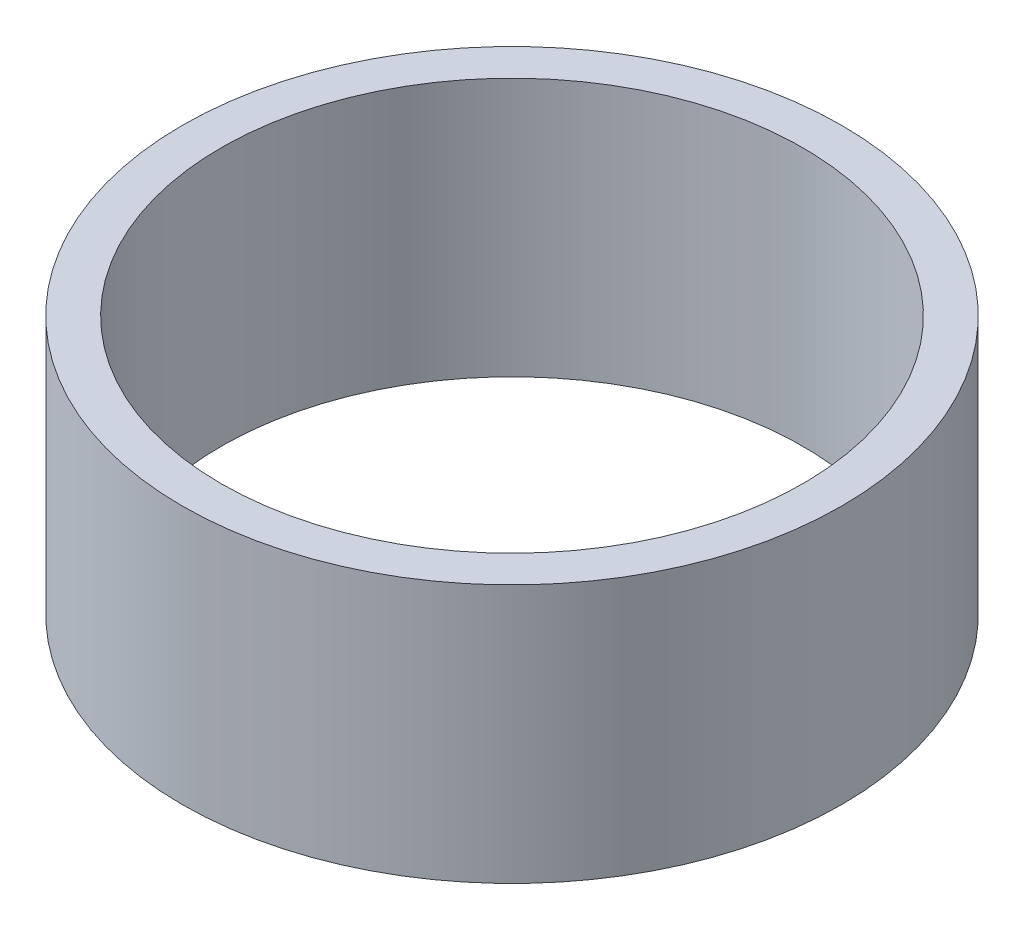
ISO-10303-21;
HEADER;
FILE_DESCRIPTION(('STEP AP214'),'2;1');
FILE_NAME('part.step','',(''),(''),'','','');
FILE_SCHEMA(('AUTOMOTIVE_DESIGN { 1 0 10303 214 1 1 1 1 }'));
ENDSEC;
DATA;
#1=APPLICATION_CONTEXT('core data for automotive mechanical design processes');
#2=APPLICATION_PROTOCOL_DEFINITION('international standard','automotive_design',2000,#1);
#3=PRODUCT_CONTEXT('',#1,'mechanical');
#4=PRODUCT('Part','Part','',(#3));
#5=PRODUCT_RELATED_PRODUCT_CATEGORY('part','',(#4));
#6=PRODUCT_DEFINITION_FORMATION('','',#4);
#7=PRODUCT_DEFINITION_CONTEXT('part definition',#1,'design');
#8=PRODUCT_DEFINITION('design','',#6,#7);
#9=PRODUCT_DEFINITION_SHAPE('','',#8);
#10=(LENGTH_UNIT() NAMED_UNIT(*) SI_UNIT(.MILLI.,.METRE.));
#11=(NAMED_UNIT(*) PLANE_ANGLE_UNIT() SI_UNIT($,.RADIAN.));
#12=(NAMED_UNIT(*) SI_UNIT($,.STERADIAN.) SOLID_ANGLE_UNIT());
#13=UNCERTAINTY_MEASURE_WITH_UNIT(LENGTH_MEASURE(1.E-05),#10,'distance_accuracy_value','');
#14=(GEOMETRIC_REPRESENTATION_CONTEXT(3) GLOBAL_UNCERTAINTY_ASSIGNED_CONTEXT((#13)) GLOBAL_UNIT_ASSIGNED_CONTEXT((#10,
#11,#12)) REPRESENTATION_CONTEXT('',''));
#15=CARTESIAN_POINT('',(0.,0.,0.));
#16=DIRECTION('',(0.,0.,1.));
#17=DIRECTION('',(1.,0.,0.));
#18=AXIS2_PLACEMENT_3D('',#15,#16,#17);
#19=CARTESIAN_POINT('',(0.,20.,0.));
#20=DIRECTION('',(0.,1.,0.));
#21=DIRECTION('',(0.,0.,1.));
#22=AXIS2_PLACEMENT_3D('',#19,#20,#21);
#23=PLANE('',#22);
#24=CARTESIAN_POINT('',(0.,20.,0.));
#25=DIRECTION('',(0.,1.,0.));
#26=DIRECTION('',(1.,0.,0.));
#27=AXIS2_PLACEMENT_3D('',#24,#25,#26);
#28=CIRCLE('',#27,25.5);
#29=CARTESIAN_POINT('',(25.5,20.,0.));
#30=VERTEX_POINT('',#29);
#31=EDGE_CURVE('E11',#30,#30,#28,.T.);
#32=ORIENTED_EDGE('',*,*,#31,.T.);
#33=EDGE_LOOP('',(#32));
#34=FACE_BOUND('',#33,.T.);
#35=CARTESIAN_POINT('',(0.,20.,0.));
#36=DIRECTION('',(0.,1.,0.));
#37=DIRECTION('',(0.,0.,1.));
#38=AXIS2_PLACEMENT_3D('',#35,#36,#37);
#39=CIRCLE('',#38,22.5);
#40=CARTESIAN_POINT('',(0.,20.,22.5));
#41=VERTEX_POINT('',#40);
#42=EDGE_CURVE('E50',#41,#41,#39,.T.);
#43=ORIENTED_EDGE('',*,*,#42,.F.);
#44=EDGE_LOOP('',(#43));
#45=FACE_BOUND('',#44,.T.);
#46=ADVANCED_FACE('F39',(#34,#45),#23,.T.);
#47=CARTESIAN_POINT('',(0.,0.,0.));
#48=DIRECTION('',(0.,1.,0.));
#49=DIRECTION('',(0.,0.,1.));
#50=AXIS2_PLACEMENT_3D('',#47,#48,#49);
#51=PLANE('',#50);
#52=CARTESIAN_POINT('',(0.,0.,0.));
#53=DIRECTION('',(0.,1.,0.));
#54=DIRECTION('',(1.,0.,0.));
#55=AXIS2_PLACEMENT_3D('',#52,#53,#54);
#56=CIRCLE('',#55,25.5);
#57=CARTESIAN_POINT('',(25.5,0.,0.));
#58=VERTEX_POINT('',#57);
#59=EDGE_CURVE('E43',#58,#58,#56,.T.);
#60=ORIENTED_EDGE('',*,*,#59,.F.);
#61=EDGE_LOOP('',(#60));
#62=FACE_BOUND('',#61,.T.);
#63=CARTESIAN_POINT('',(0.,0.,0.));
#64=DIRECTION('',(0.,1.,0.));
#65=DIRECTION('',(0.,0.,1.));
#66=AXIS2_PLACEMENT_3D('',#63,#64,#65);
#67=CIRCLE('',#66,22.5);
#68=CARTESIAN_POINT('',(0.,0.,22.5));
#69=VERTEX_POINT('',#68);
#70=EDGE_CURVE('E52',#69,#69,#67,.T.);
#71=ORIENTED_EDGE('',*,*,#70,.T.);
#72=EDGE_LOOP('',(#71));
#73=FACE_BOUND('',#72,.T.);
#74=ADVANCED_FACE('F62',(#62,#73),#51,.F.);
#75=CARTESIAN_POINT('',(0.,20.,0.));
#76=DIRECTION('',(0.,-1.,0.));
#77=DIRECTION('',(0.,0.,-1.));
#78=AXIS2_PLACEMENT_3D('',#75,#76,#77);
#79=CYLINDRICAL_SURFACE('',#78,25.5);
#80=ORIENTED_EDGE('',*,*,#31,.F.);
#81=EDGE_LOOP('',(#80));
#82=FACE_BOUND('',#81,.T.);
#83=ORIENTED_EDGE('',*,*,#59,.T.);
#84=EDGE_LOOP('',(#83));
#85=FACE_BOUND('',#84,.T.);
#86=ADVANCED_FACE('F41',(#82,#85),#79,.T.);
#87=CARTESIAN_POINT('',(0.,20.,0.));
#88=DIRECTION('',(0.,-1.,0.));
#89=DIRECTION('',(0.,0.,-1.));
#90=AXIS2_PLACEMENT_3D('',#87,#88,#89);
#91=CYLINDRICAL_SURFACE('',#90,22.5);
#92=ORIENTED_EDGE('',*,*,#42,.T.);
#93=EDGE_LOOP('',(#92));
#94=FACE_BOUND('',#93,.T.);
#95=ORIENTED_EDGE('',*,*,#70,.F.);
#96=EDGE_LOOP('',(#95));
#97=FACE_BOUND('',#96,.T.);
#98=ADVANCED_FACE('F58',(#94,#97),#91,.F.);
#99=CLOSED_SHELL('',(#46,#74,#86,#98));
#100=MANIFOLD_SOLID_BREP('B2',#99);
#101=ADVANCED_BREP_SHAPE_REPRESENTATION('',(#18,#100),#14);
#102=SHAPE_DEFINITION_REPRESENTATION(#9,#101);
ENDSEC;
END-ISO-10303-21;
